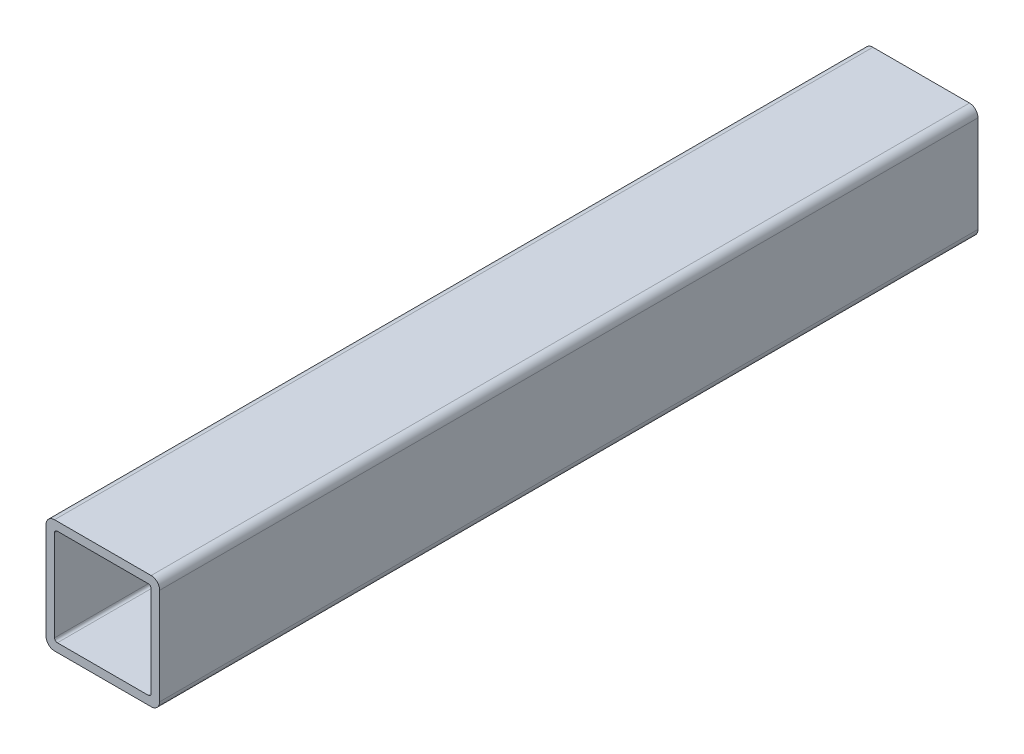
ISO-10303-21;
HEADER;
FILE_DESCRIPTION(('STEP AP214'),'2;1');
FILE_NAME('part.step','',(''),(''),'','','');
FILE_SCHEMA(('AUTOMOTIVE_DESIGN { 1 0 10303 214 1 1 1 1 }'));
ENDSEC;
DATA;
#1=APPLICATION_CONTEXT('core data for automotive mechanical design processes');
#2=APPLICATION_PROTOCOL_DEFINITION('international standard','automotive_design',2000,#1);
#3=PRODUCT_CONTEXT('',#1,'mechanical');
#4=PRODUCT('Part','Part','',(#3));
#5=PRODUCT_RELATED_PRODUCT_CATEGORY('part','',(#4));
#6=PRODUCT_DEFINITION_FORMATION('','',#4);
#7=PRODUCT_DEFINITION_CONTEXT('part definition',#1,'design');
#8=PRODUCT_DEFINITION('design','',#6,#7);
#9=PRODUCT_DEFINITION_SHAPE('','',#8);
#10=(LENGTH_UNIT() NAMED_UNIT(*) SI_UNIT(.MILLI.,.METRE.));
#11=(NAMED_UNIT(*) PLANE_ANGLE_UNIT() SI_UNIT($,.RADIAN.));
#12=(NAMED_UNIT(*) SI_UNIT($,.STERADIAN.) SOLID_ANGLE_UNIT());
#13=UNCERTAINTY_MEASURE_WITH_UNIT(LENGTH_MEASURE(1.E-05),#10,'distance_accuracy_value','');
#14=(GEOMETRIC_REPRESENTATION_CONTEXT(3) GLOBAL_UNCERTAINTY_ASSIGNED_CONTEXT((#13)) GLOBAL_UNIT_ASSIGNED_CONTEXT((#10,
#11,#12)) REPRESENTATION_CONTEXT('',''));
#15=CARTESIAN_POINT('',(0.,0.,0.));
#16=DIRECTION('',(0.,0.,1.));
#17=DIRECTION('',(1.,0.,0.));
#18=AXIS2_PLACEMENT_3D('',#15,#16,#17);
#19=CARTESIAN_POINT('',(-26.9875,-26.9875,228.6));
#20=DIRECTION('',(0.,0.,1.));
#21=DIRECTION('',(1.,0.,0.));
#22=AXIS2_PLACEMENT_3D('',#19,#20,#21);
#23=PLANE('',#22);
#24=CARTESIAN_POINT('',(-26.9875,-26.9875,228.6));
#25=DIRECTION('',(0.,0.,1.));
#26=DIRECTION('',(1.,0.,0.));
#27=AXIS2_PLACEMENT_3D('',#24,#25,#26);
#28=CIRCLE('',#27,4.7625);
#29=CARTESIAN_POINT('',(-31.75,-26.9875,228.6));
#30=VERTEX_POINT('',#29);
#31=CARTESIAN_POINT('',(-26.9875,-31.75,228.6));
#32=VERTEX_POINT('',#31);
#33=EDGE_CURVE('E211',#30,#32,#28,.T.);
#34=ORIENTED_EDGE('',*,*,#33,.T.);
#35=DIRECTION('',(1.,0.,0.));
#36=VECTOR('',#35,1.);
#37=CARTESIAN_POINT('',(-26.9875,-31.75,228.6));
#38=LINE('',#37,#36);
#39=CARTESIAN_POINT('',(26.9875,-31.75,228.6));
#40=VERTEX_POINT('',#39);
#41=EDGE_CURVE('E214',#32,#40,#38,.T.);
#42=ORIENTED_EDGE('',*,*,#41,.T.);
#43=CARTESIAN_POINT('',(26.9875,-26.9875,228.6));
#44=DIRECTION('',(0.,0.,1.));
#45=DIRECTION('',(1.,0.,0.));
#46=AXIS2_PLACEMENT_3D('',#43,#44,#45);
#47=CIRCLE('',#46,4.7625);
#48=CARTESIAN_POINT('',(31.75,-26.9875,228.6));
#49=VERTEX_POINT('',#48);
#50=EDGE_CURVE('E217',#40,#49,#47,.T.);
#51=ORIENTED_EDGE('',*,*,#50,.T.);
#52=DIRECTION('',(0.,1.,0.));
#53=VECTOR('',#52,1.);
#54=CARTESIAN_POINT('',(31.75,26.9875,228.6));
#55=LINE('',#54,#53);
#56=CARTESIAN_POINT('',(31.75,26.9875,228.6));
#57=VERTEX_POINT('',#56);
#58=EDGE_CURVE('E219',#49,#57,#55,.T.);
#59=ORIENTED_EDGE('',*,*,#58,.T.);
#60=CARTESIAN_POINT('',(26.9875,26.9875,228.6));
#61=DIRECTION('',(0.,0.,1.));
#62=DIRECTION('',(1.,0.,0.));
#63=AXIS2_PLACEMENT_3D('',#60,#61,#62);
#64=CIRCLE('',#63,4.7625);
#65=CARTESIAN_POINT('',(26.9875,31.75,228.6));
#66=VERTEX_POINT('',#65);
#67=EDGE_CURVE('E221',#57,#66,#64,.T.);
#68=ORIENTED_EDGE('',*,*,#67,.T.);
#69=DIRECTION('',(-1.,0.,0.));
#70=VECTOR('',#69,1.);
#71=CARTESIAN_POINT('',(-26.9875,31.75,228.6));
#72=LINE('',#71,#70);
#73=CARTESIAN_POINT('',(-26.9875,31.75,228.6));
#74=VERTEX_POINT('',#73);
#75=EDGE_CURVE('E223',#66,#74,#72,.T.);
#76=ORIENTED_EDGE('',*,*,#75,.T.);
#77=CARTESIAN_POINT('',(-26.9875,26.9875,228.6));
#78=DIRECTION('',(0.,0.,1.));
#79=DIRECTION('',(1.,0.,0.));
#80=AXIS2_PLACEMENT_3D('',#77,#78,#79);
#81=CIRCLE('',#80,4.7625);
#82=CARTESIAN_POINT('',(-31.75,26.9875,228.6));
#83=VERTEX_POINT('',#82);
#84=EDGE_CURVE('E225',#74,#83,#81,.T.);
#85=ORIENTED_EDGE('',*,*,#84,.T.);
#86=DIRECTION('',(0.,-1.,0.));
#87=VECTOR('',#86,1.);
#88=CARTESIAN_POINT('',(-31.75,26.9875,228.6));
#89=LINE('',#88,#87);
#90=EDGE_CURVE('E227',#83,#30,#89,.T.);
#91=ORIENTED_EDGE('',*,*,#90,.T.);
#92=EDGE_LOOP('',(#34,#42,#51,#59,#68,#76,#85,#91));
#93=FACE_BOUND('',#92,.T.);
#94=DIRECTION('',(1.,0.,0.));
#95=VECTOR('',#94,1.);
#96=CARTESIAN_POINT('',(-25.4,-26.9875,228.6));
#97=LINE('',#96,#95);
#98=CARTESIAN_POINT('',(-25.4,-26.9875,228.6));
#99=VERTEX_POINT('',#98);
#100=CARTESIAN_POINT('',(25.4,-26.9875,228.6));
#101=VERTEX_POINT('',#100);
#102=EDGE_CURVE('E154',#99,#101,#97,.T.);
#103=ORIENTED_EDGE('',*,*,#102,.F.);
#104=CARTESIAN_POINT('',(-25.4,-25.4,228.6));
#105=DIRECTION('',(0.,0.,1.));
#106=DIRECTION('',(1.,0.,0.));
#107=AXIS2_PLACEMENT_3D('',#104,#105,#106);
#108=CIRCLE('',#107,1.5875);
#109=CARTESIAN_POINT('',(-26.9875,-25.4,228.6));
#110=VERTEX_POINT('',#109);
#111=EDGE_CURVE('E146',#110,#99,#108,.T.);
#112=ORIENTED_EDGE('',*,*,#111,.F.);
#113=DIRECTION('',(0.,-1.,0.));
#114=VECTOR('',#113,1.);
#115=CARTESIAN_POINT('',(-26.9875,25.4,228.6));
#116=LINE('',#115,#114);
#117=CARTESIAN_POINT('',(-26.9875,25.4,228.6));
#118=VERTEX_POINT('',#117);
#119=EDGE_CURVE('E179',#118,#110,#116,.T.);
#120=ORIENTED_EDGE('',*,*,#119,.F.);
#121=CARTESIAN_POINT('',(-25.4,25.4,228.6));
#122=DIRECTION('',(0.,0.,1.));
#123=DIRECTION('',(1.,0.,0.));
#124=AXIS2_PLACEMENT_3D('',#121,#122,#123);
#125=CIRCLE('',#124,1.5875);
#126=CARTESIAN_POINT('',(-25.4,26.9875,228.6));
#127=VERTEX_POINT('',#126);
#128=EDGE_CURVE('E177',#127,#118,#125,.T.);
#129=ORIENTED_EDGE('',*,*,#128,.F.);
#130=DIRECTION('',(-1.,0.,0.));
#131=VECTOR('',#130,1.);
#132=CARTESIAN_POINT('',(-25.4,26.9875,228.6));
#133=LINE('',#132,#131);
#134=CARTESIAN_POINT('',(25.4,26.9875,228.6));
#135=VERTEX_POINT('',#134);
#136=EDGE_CURVE('E175',#135,#127,#133,.T.);
#137=ORIENTED_EDGE('',*,*,#136,.F.);
#138=CARTESIAN_POINT('',(25.4,25.4,228.6));
#139=DIRECTION('',(0.,0.,1.));
#140=DIRECTION('',(1.,0.,0.));
#141=AXIS2_PLACEMENT_3D('',#138,#139,#140);
#142=CIRCLE('',#141,1.5875);
#143=CARTESIAN_POINT('',(26.9875,25.4,228.6));
#144=VERTEX_POINT('',#143);
#145=EDGE_CURVE('E173',#144,#135,#142,.T.);
#146=ORIENTED_EDGE('',*,*,#145,.F.);
#147=DIRECTION('',(0.,1.,0.));
#148=VECTOR('',#147,1.);
#149=CARTESIAN_POINT('',(26.9875,25.4,228.6));
#150=LINE('',#149,#148);
#151=CARTESIAN_POINT('',(26.9875,-25.4,228.6));
#152=VERTEX_POINT('',#151);
#153=EDGE_CURVE('E169',#152,#144,#150,.T.);
#154=ORIENTED_EDGE('',*,*,#153,.F.);
#155=CARTESIAN_POINT('',(25.4,-25.4,228.6));
#156=DIRECTION('',(0.,0.,1.));
#157=DIRECTION('',(1.,0.,0.));
#158=AXIS2_PLACEMENT_3D('',#155,#156,#157);
#159=CIRCLE('',#158,1.5875);
#160=EDGE_CURVE('E167',#101,#152,#159,.T.);
#161=ORIENTED_EDGE('',*,*,#160,.F.);
#162=EDGE_LOOP('',(#103,#112,#120,#129,#137,#146,#154,#161));
#163=FACE_BOUND('',#162,.T.);
#164=ADVANCED_FACE('F33',(#93,#163),#23,.T.);
#165=CARTESIAN_POINT('',(-26.9875,-26.9875,-228.6));
#166=DIRECTION('',(0.,0.,1.));
#167=DIRECTION('',(1.,0.,0.));
#168=AXIS2_PLACEMENT_3D('',#165,#166,#167);
#169=PLANE('',#168);
#170=CARTESIAN_POINT('',(-26.9875,-26.9875,-228.6));
#171=DIRECTION('',(0.,0.,1.));
#172=DIRECTION('',(1.,0.,0.));
#173=AXIS2_PLACEMENT_3D('',#170,#171,#172);
#174=CIRCLE('',#173,4.7625);
#175=CARTESIAN_POINT('',(-31.75,-26.9875,-228.6));
#176=VERTEX_POINT('',#175);
#177=CARTESIAN_POINT('',(-26.9875,-31.75,-228.6));
#178=VERTEX_POINT('',#177);
#179=EDGE_CURVE('E162',#176,#178,#174,.T.);
#180=ORIENTED_EDGE('',*,*,#179,.F.);
#181=DIRECTION('',(0.,-1.,0.));
#182=VECTOR('',#181,1.);
#183=CARTESIAN_POINT('',(-31.75,26.9875,-228.6));
#184=LINE('',#183,#182);
#185=CARTESIAN_POINT('',(-31.75,26.9875,-228.6));
#186=VERTEX_POINT('',#185);
#187=EDGE_CURVE('E215',#186,#176,#184,.T.);
#188=ORIENTED_EDGE('',*,*,#187,.F.);
#189=CARTESIAN_POINT('',(-26.9875,26.9875,-228.6));
#190=DIRECTION('',(0.,0.,1.));
#191=DIRECTION('',(1.,0.,0.));
#192=AXIS2_PLACEMENT_3D('',#189,#190,#191);
#193=CIRCLE('',#192,4.7625);
#194=CARTESIAN_POINT('',(-26.9875,31.75,-228.6));
#195=VERTEX_POINT('',#194);
#196=EDGE_CURVE('E242',#195,#186,#193,.T.);
#197=ORIENTED_EDGE('',*,*,#196,.F.);
#198=DIRECTION('',(-1.,0.,0.));
#199=VECTOR('',#198,1.);
#200=CARTESIAN_POINT('',(-26.9875,31.75,-228.6));
#201=LINE('',#200,#199);
#202=CARTESIAN_POINT('',(26.9875,31.75,-228.6));
#203=VERTEX_POINT('',#202);
#204=EDGE_CURVE('E240',#203,#195,#201,.T.);
#205=ORIENTED_EDGE('',*,*,#204,.F.);
#206=CARTESIAN_POINT('',(26.9875,26.9875,-228.6));
#207=DIRECTION('',(0.,0.,1.));
#208=DIRECTION('',(1.,0.,0.));
#209=AXIS2_PLACEMENT_3D('',#206,#207,#208);
#210=CIRCLE('',#209,4.7625);
#211=CARTESIAN_POINT('',(31.75,26.9875,-228.6));
#212=VERTEX_POINT('',#211);
#213=EDGE_CURVE('E238',#212,#203,#210,.T.);
#214=ORIENTED_EDGE('',*,*,#213,.F.);
#215=DIRECTION('',(0.,1.,0.));
#216=VECTOR('',#215,1.);
#217=CARTESIAN_POINT('',(31.75,26.9875,-228.6));
#218=LINE('',#217,#216);
#219=CARTESIAN_POINT('',(31.75,-26.9875,-228.6));
#220=VERTEX_POINT('',#219);
#221=EDGE_CURVE('E236',#220,#212,#218,.T.);
#222=ORIENTED_EDGE('',*,*,#221,.F.);
#223=CARTESIAN_POINT('',(26.9875,-26.9875,-228.6));
#224=DIRECTION('',(0.,0.,1.));
#225=DIRECTION('',(1.,0.,0.));
#226=AXIS2_PLACEMENT_3D('',#223,#224,#225);
#227=CIRCLE('',#226,4.7625);
#228=CARTESIAN_POINT('',(26.9875,-31.75,-228.6));
#229=VERTEX_POINT('',#228);
#230=EDGE_CURVE('E234',#229,#220,#227,.T.);
#231=ORIENTED_EDGE('',*,*,#230,.F.);
#232=DIRECTION('',(1.,0.,0.));
#233=VECTOR('',#232,1.);
#234=CARTESIAN_POINT('',(-26.9875,-31.75,-228.6));
#235=LINE('',#234,#233);
#236=EDGE_CURVE('E232',#178,#229,#235,.T.);
#237=ORIENTED_EDGE('',*,*,#236,.F.);
#238=EDGE_LOOP('',(#180,#188,#197,#205,#214,#222,#231,#237));
#239=FACE_BOUND('',#238,.T.);
#240=CARTESIAN_POINT('',(-25.4,-25.4,-228.6));
#241=DIRECTION('',(0.,0.,1.));
#242=DIRECTION('',(1.,0.,0.));
#243=AXIS2_PLACEMENT_3D('',#240,#241,#242);
#244=CIRCLE('',#243,1.5875);
#245=CARTESIAN_POINT('',(-26.9875,-25.4,-228.6));
#246=VERTEX_POINT('',#245);
#247=CARTESIAN_POINT('',(-25.4,-26.9875,-228.6));
#248=VERTEX_POINT('',#247);
#249=EDGE_CURVE('E56',#246,#248,#244,.T.);
#250=ORIENTED_EDGE('',*,*,#249,.T.);
#251=DIRECTION('',(1.,0.,0.));
#252=VECTOR('',#251,1.);
#253=CARTESIAN_POINT('',(-25.4,-26.9875,-228.6));
#254=LINE('',#253,#252);
#255=CARTESIAN_POINT('',(25.4,-26.9875,-228.6));
#256=VERTEX_POINT('',#255);
#257=EDGE_CURVE('E161',#248,#256,#254,.T.);
#258=ORIENTED_EDGE('',*,*,#257,.T.);
#259=CARTESIAN_POINT('',(25.4,-25.4,-228.6));
#260=DIRECTION('',(0.,0.,1.));
#261=DIRECTION('',(1.,0.,0.));
#262=AXIS2_PLACEMENT_3D('',#259,#260,#261);
#263=CIRCLE('',#262,1.5875);
#264=CARTESIAN_POINT('',(26.9875,-25.4,-228.6));
#265=VERTEX_POINT('',#264);
#266=EDGE_CURVE('E183',#256,#265,#263,.T.);
#267=ORIENTED_EDGE('',*,*,#266,.T.);
#268=DIRECTION('',(0.,1.,0.));
#269=VECTOR('',#268,1.);
#270=CARTESIAN_POINT('',(26.9875,25.4,-228.6));
#271=LINE('',#270,#269);
#272=CARTESIAN_POINT('',(26.9875,25.4,-228.6));
#273=VERTEX_POINT('',#272);
#274=EDGE_CURVE('E186',#265,#273,#271,.T.);
#275=ORIENTED_EDGE('',*,*,#274,.T.);
#276=CARTESIAN_POINT('',(25.4,25.4,-228.6));
#277=DIRECTION('',(0.,0.,1.));
#278=DIRECTION('',(1.,0.,0.));
#279=AXIS2_PLACEMENT_3D('',#276,#277,#278);
#280=CIRCLE('',#279,1.5875);
#281=CARTESIAN_POINT('',(25.4,26.9875,-228.6));
#282=VERTEX_POINT('',#281);
#283=EDGE_CURVE('E189',#273,#282,#280,.T.);
#284=ORIENTED_EDGE('',*,*,#283,.T.);
#285=DIRECTION('',(-1.,0.,0.));
#286=VECTOR('',#285,1.);
#287=CARTESIAN_POINT('',(-25.4,26.9875,-228.6));
#288=LINE('',#287,#286);
#289=CARTESIAN_POINT('',(-25.4,26.9875,-228.6));
#290=VERTEX_POINT('',#289);
#291=EDGE_CURVE('E192',#282,#290,#288,.T.);
#292=ORIENTED_EDGE('',*,*,#291,.T.);
#293=CARTESIAN_POINT('',(-25.4,25.4,-228.6));
#294=DIRECTION('',(0.,0.,1.));
#295=DIRECTION('',(1.,0.,0.));
#296=AXIS2_PLACEMENT_3D('',#293,#294,#295);
#297=CIRCLE('',#296,1.5875);
#298=CARTESIAN_POINT('',(-26.9875,25.4,-228.6));
#299=VERTEX_POINT('',#298);
#300=EDGE_CURVE('E195',#290,#299,#297,.T.);
#301=ORIENTED_EDGE('',*,*,#300,.T.);
#302=DIRECTION('',(0.,-1.,0.));
#303=VECTOR('',#302,1.);
#304=CARTESIAN_POINT('',(-26.9875,25.4,-228.6));
#305=LINE('',#304,#303);
#306=EDGE_CURVE('E155',#299,#246,#305,.T.);
#307=ORIENTED_EDGE('',*,*,#306,.T.);
#308=EDGE_LOOP('',(#250,#258,#267,#275,#284,#292,#301,#307));
#309=FACE_BOUND('',#308,.T.);
#310=ADVANCED_FACE('F272',(#239,#309),#169,.F.);
#311=CARTESIAN_POINT('',(-26.9875,-26.9875,228.6));
#312=DIRECTION('',(0.,0.,-1.));
#313=DIRECTION('',(-1.,0.,0.));
#314=AXIS2_PLACEMENT_3D('',#311,#312,#313);
#315=CYLINDRICAL_SURFACE('',#314,4.7625);
#316=ORIENTED_EDGE('',*,*,#179,.T.);
#317=DIRECTION('',(0.,0.,-1.));
#318=VECTOR('',#317,1.);
#319=CARTESIAN_POINT('',(-26.9875,-31.75,228.6));
#320=LINE('',#319,#318);
#321=EDGE_CURVE('E11',#32,#178,#320,.T.);
#322=ORIENTED_EDGE('',*,*,#321,.F.);
#323=ORIENTED_EDGE('',*,*,#33,.F.);
#324=DIRECTION('',(0.,0.,-1.));
#325=VECTOR('',#324,1.);
#326=CARTESIAN_POINT('',(-31.75,-26.9875,228.6));
#327=LINE('',#326,#325);
#328=EDGE_CURVE('E229',#30,#176,#327,.T.);
#329=ORIENTED_EDGE('',*,*,#328,.T.);
#330=EDGE_LOOP('',(#316,#322,#323,#329));
#331=FACE_BOUND('',#330,.T.);
#332=ADVANCED_FACE('F35',(#331),#315,.T.);
#333=CARTESIAN_POINT('',(-26.9875,-31.75,228.6));
#334=DIRECTION('',(0.,1.,0.));
#335=DIRECTION('',(0.,0.,1.));
#336=AXIS2_PLACEMENT_3D('',#333,#334,#335);
#337=PLANE('',#336);
#338=ORIENTED_EDGE('',*,*,#236,.T.);
#339=DIRECTION('',(0.,0.,-1.));
#340=VECTOR('',#339,1.);
#341=CARTESIAN_POINT('',(26.9875,-31.75,228.6));
#342=LINE('',#341,#340);
#343=EDGE_CURVE('E41',#40,#229,#342,.T.);
#344=ORIENTED_EDGE('',*,*,#343,.F.);
#345=ORIENTED_EDGE('',*,*,#41,.F.);
#346=ORIENTED_EDGE('',*,*,#321,.T.);
#347=EDGE_LOOP('',(#338,#344,#345,#346));
#348=FACE_BOUND('',#347,.T.);
#349=ADVANCED_FACE('F289',(#348),#337,.F.);
#350=CARTESIAN_POINT('',(26.9875,-26.9875,228.6));
#351=DIRECTION('',(0.,0.,-1.));
#352=DIRECTION('',(-1.,0.,0.));
#353=AXIS2_PLACEMENT_3D('',#350,#351,#352);
#354=CYLINDRICAL_SURFACE('',#353,4.7625);
#355=ORIENTED_EDGE('',*,*,#230,.T.);
#356=DIRECTION('',(0.,0.,-1.));
#357=VECTOR('',#356,1.);
#358=CARTESIAN_POINT('',(31.75,-26.9875,228.6));
#359=LINE('',#358,#357);
#360=EDGE_CURVE('E259',#49,#220,#359,.T.);
#361=ORIENTED_EDGE('',*,*,#360,.F.);
#362=ORIENTED_EDGE('',*,*,#50,.F.);
#363=ORIENTED_EDGE('',*,*,#343,.T.);
#364=EDGE_LOOP('',(#355,#361,#362,#363));
#365=FACE_BOUND('',#364,.T.);
#366=ADVANCED_FACE('F266',(#365),#354,.T.);
#367=CARTESIAN_POINT('',(31.75,26.9875,228.6));
#368=DIRECTION('',(-1.,0.,0.));
#369=DIRECTION('',(0.,0.,1.));
#370=AXIS2_PLACEMENT_3D('',#367,#368,#369);
#371=PLANE('',#370);
#372=ORIENTED_EDGE('',*,*,#221,.T.);
#373=DIRECTION('',(0.,0.,-1.));
#374=VECTOR('',#373,1.);
#375=CARTESIAN_POINT('',(31.75,26.9875,228.6));
#376=LINE('',#375,#374);
#377=EDGE_CURVE('E256',#57,#212,#376,.T.);
#378=ORIENTED_EDGE('',*,*,#377,.F.);
#379=ORIENTED_EDGE('',*,*,#58,.F.);
#380=ORIENTED_EDGE('',*,*,#360,.T.);
#381=EDGE_LOOP('',(#372,#378,#379,#380));
#382=FACE_BOUND('',#381,.T.);
#383=ADVANCED_FACE('F278',(#382),#371,.F.);
#384=CARTESIAN_POINT('',(26.9875,26.9875,228.6));
#385=DIRECTION('',(0.,0.,-1.));
#386=DIRECTION('',(-1.,0.,0.));
#387=AXIS2_PLACEMENT_3D('',#384,#385,#386);
#388=CYLINDRICAL_SURFACE('',#387,4.7625);
#389=ORIENTED_EDGE('',*,*,#213,.T.);
#390=DIRECTION('',(0.,0.,-1.));
#391=VECTOR('',#390,1.);
#392=CARTESIAN_POINT('',(26.9875,31.75,228.6));
#393=LINE('',#392,#391);
#394=EDGE_CURVE('E253',#66,#203,#393,.T.);
#395=ORIENTED_EDGE('',*,*,#394,.F.);
#396=ORIENTED_EDGE('',*,*,#67,.F.);
#397=ORIENTED_EDGE('',*,*,#377,.T.);
#398=EDGE_LOOP('',(#389,#395,#396,#397));
#399=FACE_BOUND('',#398,.T.);
#400=ADVANCED_FACE('F282',(#399),#388,.T.);
#401=CARTESIAN_POINT('',(-26.9875,31.75,228.6));
#402=DIRECTION('',(0.,-1.,0.));
#403=DIRECTION('',(0.,0.,-1.));
#404=AXIS2_PLACEMENT_3D('',#401,#402,#403);
#405=PLANE('',#404);
#406=ORIENTED_EDGE('',*,*,#204,.T.);
#407=DIRECTION('',(0.,0.,-1.));
#408=VECTOR('',#407,1.);
#409=CARTESIAN_POINT('',(-26.9875,31.75,228.6));
#410=LINE('',#409,#408);
#411=EDGE_CURVE('E250',#74,#195,#410,.T.);
#412=ORIENTED_EDGE('',*,*,#411,.F.);
#413=ORIENTED_EDGE('',*,*,#75,.F.);
#414=ORIENTED_EDGE('',*,*,#394,.T.);
#415=EDGE_LOOP('',(#406,#412,#413,#414));
#416=FACE_BOUND('',#415,.T.);
#417=ADVANCED_FACE('F302',(#416),#405,.F.);
#418=CARTESIAN_POINT('',(-26.9875,26.9875,228.6));
#419=DIRECTION('',(0.,0.,-1.));
#420=DIRECTION('',(-1.,0.,0.));
#421=AXIS2_PLACEMENT_3D('',#418,#419,#420);
#422=CYLINDRICAL_SURFACE('',#421,4.7625);
#423=ORIENTED_EDGE('',*,*,#196,.T.);
#424=DIRECTION('',(0.,0.,-1.));
#425=VECTOR('',#424,1.);
#426=CARTESIAN_POINT('',(-31.75,26.9875,228.6));
#427=LINE('',#426,#425);
#428=EDGE_CURVE('E247',#83,#186,#427,.T.);
#429=ORIENTED_EDGE('',*,*,#428,.F.);
#430=ORIENTED_EDGE('',*,*,#84,.F.);
#431=ORIENTED_EDGE('',*,*,#411,.T.);
#432=EDGE_LOOP('',(#423,#429,#430,#431));
#433=FACE_BOUND('',#432,.T.);
#434=ADVANCED_FACE('F300',(#433),#422,.T.);
#435=CARTESIAN_POINT('',(-31.75,26.9875,228.6));
#436=DIRECTION('',(1.,0.,0.));
#437=DIRECTION('',(0.,0.,-1.));
#438=AXIS2_PLACEMENT_3D('',#435,#436,#437);
#439=PLANE('',#438);
#440=ORIENTED_EDGE('',*,*,#187,.T.);
#441=ORIENTED_EDGE('',*,*,#328,.F.);
#442=ORIENTED_EDGE('',*,*,#90,.F.);
#443=ORIENTED_EDGE('',*,*,#428,.T.);
#444=EDGE_LOOP('',(#440,#441,#442,#443));
#445=FACE_BOUND('',#444,.T.);
#446=ADVANCED_FACE('F295',(#445),#439,.F.);
#447=CARTESIAN_POINT('',(-25.4,-25.4,228.6));
#448=DIRECTION('',(0.,0.,-1.));
#449=DIRECTION('',(-1.,0.,0.));
#450=AXIS2_PLACEMENT_3D('',#447,#448,#449);
#451=CYLINDRICAL_SURFACE('',#450,1.5875);
#452=ORIENTED_EDGE('',*,*,#249,.F.);
#453=DIRECTION('',(0.,0.,-1.));
#454=VECTOR('',#453,1.);
#455=CARTESIAN_POINT('',(-26.9875,-25.4,228.6));
#456=LINE('',#455,#454);
#457=EDGE_CURVE('E150',#110,#246,#456,.T.);
#458=ORIENTED_EDGE('',*,*,#457,.F.);
#459=ORIENTED_EDGE('',*,*,#111,.T.);
#460=DIRECTION('',(0.,0.,-1.));
#461=VECTOR('',#460,1.);
#462=CARTESIAN_POINT('',(-25.4,-26.9875,228.6));
#463=LINE('',#462,#461);
#464=EDGE_CURVE('E149',#99,#248,#463,.T.);
#465=ORIENTED_EDGE('',*,*,#464,.T.);
#466=EDGE_LOOP('',(#452,#458,#459,#465));
#467=FACE_BOUND('',#466,.T.);
#468=ADVANCED_FACE('F148',(#467),#451,.F.);
#469=CARTESIAN_POINT('',(-25.4,-26.9875,228.6));
#470=DIRECTION('',(0.,1.,0.));
#471=DIRECTION('',(0.,0.,1.));
#472=AXIS2_PLACEMENT_3D('',#469,#470,#471);
#473=PLANE('',#472);
#474=ORIENTED_EDGE('',*,*,#257,.F.);
#475=ORIENTED_EDGE('',*,*,#464,.F.);
#476=ORIENTED_EDGE('',*,*,#102,.T.);
#477=DIRECTION('',(0.,0.,-1.));
#478=VECTOR('',#477,1.);
#479=CARTESIAN_POINT('',(25.4,-26.9875,228.6));
#480=LINE('',#479,#478);
#481=EDGE_CURVE('E163',#101,#256,#480,.T.);
#482=ORIENTED_EDGE('',*,*,#481,.T.);
#483=EDGE_LOOP('',(#474,#475,#476,#482));
#484=FACE_BOUND('',#483,.T.);
#485=ADVANCED_FACE('F158',(#484),#473,.T.);
#486=CARTESIAN_POINT('',(25.4,-25.4,228.6));
#487=DIRECTION('',(0.,0.,-1.));
#488=DIRECTION('',(-1.,0.,0.));
#489=AXIS2_PLACEMENT_3D('',#486,#487,#488);
#490=CYLINDRICAL_SURFACE('',#489,1.5875);
#491=ORIENTED_EDGE('',*,*,#266,.F.);
#492=ORIENTED_EDGE('',*,*,#481,.F.);
#493=ORIENTED_EDGE('',*,*,#160,.T.);
#494=DIRECTION('',(0.,0.,-1.));
#495=VECTOR('',#494,1.);
#496=CARTESIAN_POINT('',(26.9875,-25.4,228.6));
#497=LINE('',#496,#495);
#498=EDGE_CURVE('E208',#152,#265,#497,.T.);
#499=ORIENTED_EDGE('',*,*,#498,.T.);
#500=EDGE_LOOP('',(#491,#492,#493,#499));
#501=FACE_BOUND('',#500,.T.);
#502=ADVANCED_FACE('F327',(#501),#490,.F.);
#503=CARTESIAN_POINT('',(26.9875,25.4,228.6));
#504=DIRECTION('',(-1.,0.,0.));
#505=DIRECTION('',(0.,-1.,0.));
#506=AXIS2_PLACEMENT_3D('',#503,#504,#505);
#507=PLANE('',#506);
#508=ORIENTED_EDGE('',*,*,#274,.F.);
#509=ORIENTED_EDGE('',*,*,#498,.F.);
#510=ORIENTED_EDGE('',*,*,#153,.T.);
#511=DIRECTION('',(0.,0.,-1.));
#512=VECTOR('',#511,1.);
#513=CARTESIAN_POINT('',(26.9875,25.4,228.6));
#514=LINE('',#513,#512);
#515=EDGE_CURVE('E206',#144,#273,#514,.T.);
#516=ORIENTED_EDGE('',*,*,#515,.T.);
#517=EDGE_LOOP('',(#508,#509,#510,#516));
#518=FACE_BOUND('',#517,.T.);
#519=ADVANCED_FACE('F331',(#518),#507,.T.);
#520=CARTESIAN_POINT('',(25.4,25.4,228.6));
#521=DIRECTION('',(0.,0.,-1.));
#522=DIRECTION('',(-1.,0.,0.));
#523=AXIS2_PLACEMENT_3D('',#520,#521,#522);
#524=CYLINDRICAL_SURFACE('',#523,1.5875);
#525=ORIENTED_EDGE('',*,*,#283,.F.);
#526=ORIENTED_EDGE('',*,*,#515,.F.);
#527=ORIENTED_EDGE('',*,*,#145,.T.);
#528=DIRECTION('',(0.,0.,-1.));
#529=VECTOR('',#528,1.);
#530=CARTESIAN_POINT('',(25.4,26.9875,228.6));
#531=LINE('',#530,#529);
#532=EDGE_CURVE('E204',#135,#282,#531,.T.);
#533=ORIENTED_EDGE('',*,*,#532,.T.);
#534=EDGE_LOOP('',(#525,#526,#527,#533));
#535=FACE_BOUND('',#534,.T.);
#536=ADVANCED_FACE('F337',(#535),#524,.F.);
#537=CARTESIAN_POINT('',(-25.4,26.9875,228.6));
#538=DIRECTION('',(0.,-1.,0.));
#539=DIRECTION('',(0.,0.,-1.));
#540=AXIS2_PLACEMENT_3D('',#537,#538,#539);
#541=PLANE('',#540);
#542=ORIENTED_EDGE('',*,*,#291,.F.);
#543=ORIENTED_EDGE('',*,*,#532,.F.);
#544=ORIENTED_EDGE('',*,*,#136,.T.);
#545=DIRECTION('',(0.,0.,-1.));
#546=VECTOR('',#545,1.);
#547=CARTESIAN_POINT('',(-25.4,26.9875,228.6));
#548=LINE('',#547,#546);
#549=EDGE_CURVE('E202',#127,#290,#548,.T.);
#550=ORIENTED_EDGE('',*,*,#549,.T.);
#551=EDGE_LOOP('',(#542,#543,#544,#550));
#552=FACE_BOUND('',#551,.T.);
#553=ADVANCED_FACE('F341',(#552),#541,.T.);
#554=CARTESIAN_POINT('',(-25.4,25.4,228.6));
#555=DIRECTION('',(0.,0.,-1.));
#556=DIRECTION('',(-1.,0.,0.));
#557=AXIS2_PLACEMENT_3D('',#554,#555,#556);
#558=CYLINDRICAL_SURFACE('',#557,1.5875);
#559=ORIENTED_EDGE('',*,*,#300,.F.);
#560=ORIENTED_EDGE('',*,*,#549,.F.);
#561=ORIENTED_EDGE('',*,*,#128,.T.);
#562=DIRECTION('',(0.,0.,-1.));
#563=VECTOR('',#562,1.);
#564=CARTESIAN_POINT('',(-26.9875,25.4,228.6));
#565=LINE('',#564,#563);
#566=EDGE_CURVE('E48',#118,#299,#565,.T.);
#567=ORIENTED_EDGE('',*,*,#566,.T.);
#568=EDGE_LOOP('',(#559,#560,#561,#567));
#569=FACE_BOUND('',#568,.T.);
#570=ADVANCED_FACE('F345',(#569),#558,.F.);
#571=CARTESIAN_POINT('',(-26.9875,25.4,228.6));
#572=DIRECTION('',(1.,0.,0.));
#573=DIRECTION('',(0.,0.,-1.));
#574=AXIS2_PLACEMENT_3D('',#571,#572,#573);
#575=PLANE('',#574);
#576=ORIENTED_EDGE('',*,*,#306,.F.);
#577=ORIENTED_EDGE('',*,*,#566,.F.);
#578=ORIENTED_EDGE('',*,*,#119,.T.);
#579=ORIENTED_EDGE('',*,*,#457,.T.);
#580=EDGE_LOOP('',(#576,#577,#578,#579));
#581=FACE_BOUND('',#580,.T.);
#582=ADVANCED_FACE('F349',(#581),#575,.T.);
#583=CLOSED_SHELL('',(#164,#310,#332,#349,#366,#383,#400,#417,#434,#446,#468,#485,#502,#519,
#536,#553,#570,#582));
#584=MANIFOLD_SOLID_BREP('B2',#583);
#585=ADVANCED_BREP_SHAPE_REPRESENTATION('',(#18,#584),#14);
#586=SHAPE_DEFINITION_REPRESENTATION(#9,#585);
ENDSEC;
END-ISO-10303-21;
